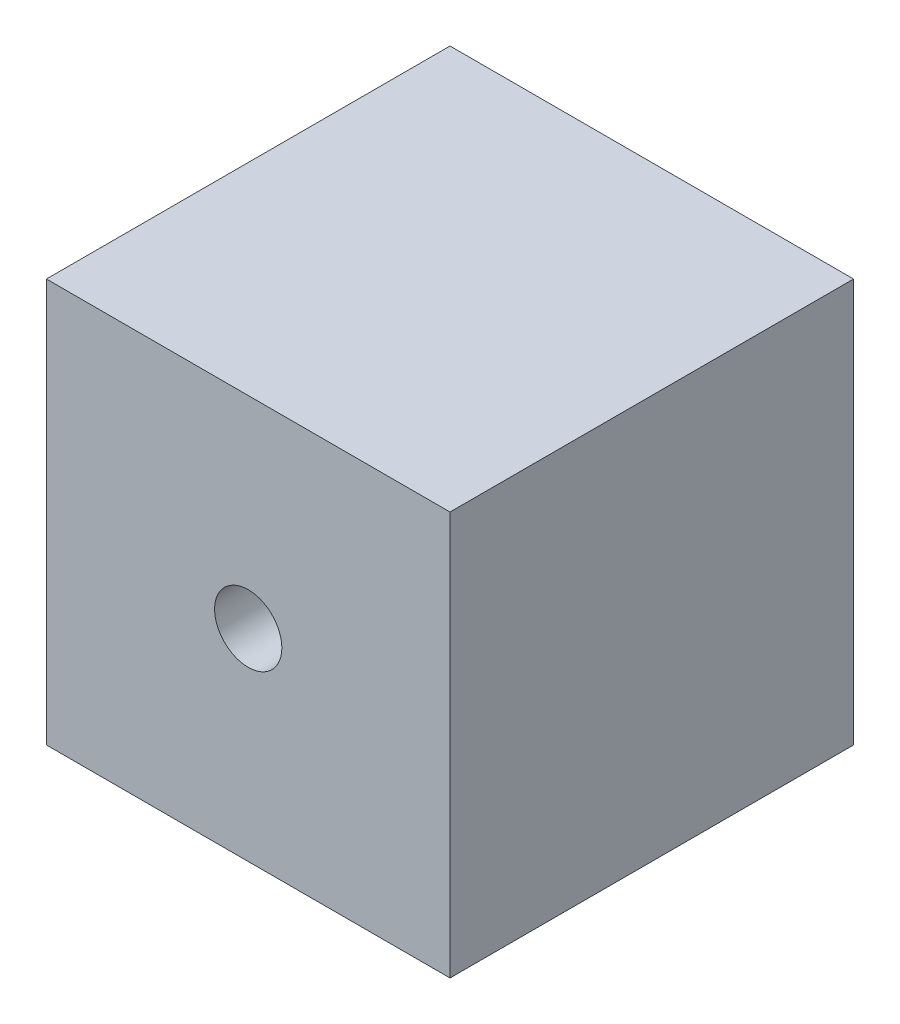
ISO-10303-21;
HEADER;
FILE_DESCRIPTION(('STEP AP214'),'2;1');
FILE_NAME('part.step','',(''),(''),'','','');
FILE_SCHEMA(('AUTOMOTIVE_DESIGN { 1 0 10303 214 1 1 1 1 }'));
ENDSEC;
DATA;
#1=APPLICATION_CONTEXT('core data for automotive mechanical design processes');
#2=APPLICATION_PROTOCOL_DEFINITION('international standard','automotive_design',2000,#1);
#3=PRODUCT_CONTEXT('',#1,'mechanical');
#4=PRODUCT('Part','Part','',(#3));
#5=PRODUCT_RELATED_PRODUCT_CATEGORY('part','',(#4));
#6=PRODUCT_DEFINITION_FORMATION('','',#4);
#7=PRODUCT_DEFINITION_CONTEXT('part definition',#1,'design');
#8=PRODUCT_DEFINITION('design','',#6,#7);
#9=PRODUCT_DEFINITION_SHAPE('','',#8);
#10=(LENGTH_UNIT() NAMED_UNIT(*) SI_UNIT(.MILLI.,.METRE.));
#11=(NAMED_UNIT(*) PLANE_ANGLE_UNIT() SI_UNIT($,.RADIAN.));
#12=(NAMED_UNIT(*) SI_UNIT($,.STERADIAN.) SOLID_ANGLE_UNIT());
#13=UNCERTAINTY_MEASURE_WITH_UNIT(LENGTH_MEASURE(1.E-05),#10,'distance_accuracy_value','');
#14=(GEOMETRIC_REPRESENTATION_CONTEXT(3) GLOBAL_UNCERTAINTY_ASSIGNED_CONTEXT((#13)) GLOBAL_UNIT_ASSIGNED_CONTEXT((#10,
#11,#12)) REPRESENTATION_CONTEXT('',''));
#15=CARTESIAN_POINT('',(0.,0.,0.));
#16=DIRECTION('',(0.,0.,1.));
#17=DIRECTION('',(1.,0.,0.));
#18=AXIS2_PLACEMENT_3D('',#15,#16,#17);
#19=CARTESIAN_POINT('',(15.,30.,0.));
#20=DIRECTION('',(0.,0.,-1.));
#21=DIRECTION('',(-1.,0.,0.));
#22=AXIS2_PLACEMENT_3D('',#19,#20,#21);
#23=PLANE('',#22);
#24=CARTESIAN_POINT('',(0.,15.,0.));
#25=DIRECTION('',(0.,0.,-1.));
#26=DIRECTION('',(-1.,0.,0.));
#27=AXIS2_PLACEMENT_3D('',#24,#25,#26);
#28=CIRCLE('',#27,2.5);
#29=CARTESIAN_POINT('',(-2.5,15.,0.));
#30=VERTEX_POINT('',#29);
#31=EDGE_CURVE('E36',#30,#30,#28,.T.);
#32=ORIENTED_EDGE('',*,*,#31,.T.);
#33=EDGE_LOOP('',(#32));
#34=FACE_BOUND('',#33,.T.);
#35=DIRECTION('',(0.,-1.,0.));
#36=VECTOR('',#35,1.);
#37=CARTESIAN_POINT('',(-15.,30.,0.));
#38=LINE('',#37,#36);
#39=CARTESIAN_POINT('',(-15.,30.,0.));
#40=VERTEX_POINT('',#39);
#41=CARTESIAN_POINT('',(-15.,0.,0.));
#42=VERTEX_POINT('',#41);
#43=EDGE_CURVE('E98',#40,#42,#38,.T.);
#44=ORIENTED_EDGE('',*,*,#43,.T.);
#45=DIRECTION('',(-1.,0.,0.));
#46=VECTOR('',#45,1.);
#47=CARTESIAN_POINT('',(15.,0.,0.));
#48=LINE('',#47,#46);
#49=CARTESIAN_POINT('',(15.,0.,0.));
#50=VERTEX_POINT('',#49);
#51=EDGE_CURVE('E11',#50,#42,#48,.T.);
#52=ORIENTED_EDGE('',*,*,#51,.F.);
#53=DIRECTION('',(0.,-1.,0.));
#54=VECTOR('',#53,1.);
#55=CARTESIAN_POINT('',(15.,30.,0.));
#56=LINE('',#55,#54);
#57=CARTESIAN_POINT('',(15.,30.,0.));
#58=VERTEX_POINT('',#57);
#59=EDGE_CURVE('E85',#58,#50,#56,.T.);
#60=ORIENTED_EDGE('',*,*,#59,.F.);
#61=DIRECTION('',(-1.,0.,0.));
#62=VECTOR('',#61,1.);
#63=CARTESIAN_POINT('',(15.,30.,0.));
#64=LINE('',#63,#62);
#65=EDGE_CURVE('E94',#58,#40,#64,.T.);
#66=ORIENTED_EDGE('',*,*,#65,.T.);
#67=EDGE_LOOP('',(#44,#52,#60,#66));
#68=FACE_BOUND('',#67,.T.);
#69=ADVANCED_FACE('F33',(#34,#68),#23,.F.);
#70=CARTESIAN_POINT('',(15.,0.,0.));
#71=DIRECTION('',(0.,1.,0.));
#72=DIRECTION('',(0.,0.,1.));
#73=AXIS2_PLACEMENT_3D('',#70,#71,#72);
#74=PLANE('',#73);
#75=DIRECTION('',(0.,0.,-1.));
#76=VECTOR('',#75,1.);
#77=CARTESIAN_POINT('',(-15.,0.,0.));
#78=LINE('',#77,#76);
#79=CARTESIAN_POINT('',(-15.,0.,-30.));
#80=VERTEX_POINT('',#79);
#81=EDGE_CURVE('E89',#42,#80,#78,.T.);
#82=ORIENTED_EDGE('',*,*,#81,.T.);
#83=DIRECTION('',(-1.,0.,0.));
#84=VECTOR('',#83,1.);
#85=CARTESIAN_POINT('',(15.,0.,-30.));
#86=LINE('',#85,#84);
#87=CARTESIAN_POINT('',(15.,0.,-30.));
#88=VERTEX_POINT('',#87);
#89=EDGE_CURVE('E42',#88,#80,#86,.T.);
#90=ORIENTED_EDGE('',*,*,#89,.F.);
#91=DIRECTION('',(0.,0.,-1.));
#92=VECTOR('',#91,1.);
#93=CARTESIAN_POINT('',(15.,0.,0.));
#94=LINE('',#93,#92);
#95=EDGE_CURVE('E80',#50,#88,#94,.T.);
#96=ORIENTED_EDGE('',*,*,#95,.F.);
#97=ORIENTED_EDGE('',*,*,#51,.T.);
#98=EDGE_LOOP('',(#82,#90,#96,#97));
#99=FACE_BOUND('',#98,.T.);
#100=ADVANCED_FACE('F88',(#99),#74,.F.);
#101=CARTESIAN_POINT('',(15.,0.,-30.));
#102=DIRECTION('',(0.,0.,1.));
#103=DIRECTION('',(1.,0.,0.));
#104=AXIS2_PLACEMENT_3D('',#101,#102,#103);
#105=PLANE('',#104);
#106=DIRECTION('',(0.,1.,0.));
#107=VECTOR('',#106,1.);
#108=CARTESIAN_POINT('',(-15.,0.,-30.));
#109=LINE('',#108,#107);
#110=CARTESIAN_POINT('',(-15.,30.,-30.));
#111=VERTEX_POINT('',#110);
#112=EDGE_CURVE('E67',#80,#111,#109,.T.);
#113=ORIENTED_EDGE('',*,*,#112,.T.);
#114=DIRECTION('',(-1.,0.,0.));
#115=VECTOR('',#114,1.);
#116=CARTESIAN_POINT('',(15.,30.,-30.));
#117=LINE('',#116,#115);
#118=CARTESIAN_POINT('',(15.,30.,-30.));
#119=VERTEX_POINT('',#118);
#120=EDGE_CURVE('E90',#119,#111,#117,.T.);
#121=ORIENTED_EDGE('',*,*,#120,.F.);
#122=DIRECTION('',(0.,1.,0.));
#123=VECTOR('',#122,1.);
#124=CARTESIAN_POINT('',(15.,0.,-30.));
#125=LINE('',#124,#123);
#126=EDGE_CURVE('E83',#88,#119,#125,.T.);
#127=ORIENTED_EDGE('',*,*,#126,.F.);
#128=ORIENTED_EDGE('',*,*,#89,.T.);
#129=EDGE_LOOP('',(#113,#121,#127,#128));
#130=FACE_BOUND('',#129,.T.);
#131=ADVANCED_FACE('F92',(#130),#105,.F.);
#132=CARTESIAN_POINT('',(15.,30.,-30.));
#133=DIRECTION('',(0.,-1.,0.));
#134=DIRECTION('',(0.,0.,-1.));
#135=AXIS2_PLACEMENT_3D('',#132,#133,#134);
#136=PLANE('',#135);
#137=DIRECTION('',(0.,0.,1.));
#138=VECTOR('',#137,1.);
#139=CARTESIAN_POINT('',(-15.,30.,-30.));
#140=LINE('',#139,#138);
#141=EDGE_CURVE('E73',#111,#40,#140,.T.);
#142=ORIENTED_EDGE('',*,*,#141,.T.);
#143=ORIENTED_EDGE('',*,*,#65,.F.);
#144=DIRECTION('',(0.,0.,1.));
#145=VECTOR('',#144,1.);
#146=CARTESIAN_POINT('',(15.,30.,-30.));
#147=LINE('',#146,#145);
#148=EDGE_CURVE('E50',#119,#58,#147,.T.);
#149=ORIENTED_EDGE('',*,*,#148,.F.);
#150=ORIENTED_EDGE('',*,*,#120,.T.);
#151=EDGE_LOOP('',(#142,#143,#149,#150));
#152=FACE_BOUND('',#151,.T.);
#153=ADVANCED_FACE('F105',(#152),#136,.F.);
#154=CARTESIAN_POINT('',(15.,0.,0.));
#155=DIRECTION('',(1.,0.,0.));
#156=DIRECTION('',(0.,0.,-1.));
#157=AXIS2_PLACEMENT_3D('',#154,#155,#156);
#158=PLANE('',#157);
#159=ORIENTED_EDGE('',*,*,#59,.T.);
#160=ORIENTED_EDGE('',*,*,#95,.T.);
#161=ORIENTED_EDGE('',*,*,#126,.T.);
#162=ORIENTED_EDGE('',*,*,#148,.T.);
#163=EDGE_LOOP('',(#159,#160,#161,#162));
#164=FACE_BOUND('',#163,.T.);
#165=ADVANCED_FACE('F81',(#164),#158,.T.);
#166=CARTESIAN_POINT('',(-15.,0.,0.));
#167=DIRECTION('',(1.,0.,0.));
#168=DIRECTION('',(0.,0.,-1.));
#169=AXIS2_PLACEMENT_3D('',#166,#167,#168);
#170=PLANE('',#169);
#171=ORIENTED_EDGE('',*,*,#43,.F.);
#172=ORIENTED_EDGE('',*,*,#141,.F.);
#173=ORIENTED_EDGE('',*,*,#112,.F.);
#174=ORIENTED_EDGE('',*,*,#81,.F.);
#175=EDGE_LOOP('',(#171,#172,#173,#174));
#176=FACE_BOUND('',#175,.T.);
#177=ADVANCED_FACE('F108',(#176),#170,.F.);
#178=CARTESIAN_POINT('',(0.,15.,-5.));
#179=DIRECTION('',(0.,0.,1.));
#180=DIRECTION('',(1.,0.,0.));
#181=AXIS2_PLACEMENT_3D('',#178,#179,#180);
#182=CYLINDRICAL_SURFACE('',#181,2.5);
#183=CARTESIAN_POINT('',(0.,15.,-5.));
#184=DIRECTION('',(0.,0.,1.));
#185=DIRECTION('',(1.,0.,0.));
#186=AXIS2_PLACEMENT_3D('',#183,#184,#185);
#187=CIRCLE('',#186,2.5);
#188=CARTESIAN_POINT('',(2.5,15.,-5.));
#189=VERTEX_POINT('',#188);
#190=EDGE_CURVE('E111',#189,#189,#187,.T.);
#191=ORIENTED_EDGE('',*,*,#190,.F.);
#192=EDGE_LOOP('',(#191));
#193=FACE_BOUND('',#192,.T.);
#194=ORIENTED_EDGE('',*,*,#31,.F.);
#195=EDGE_LOOP('',(#194));
#196=FACE_BOUND('',#195,.T.);
#197=ADVANCED_FACE('F119',(#193,#196),#182,.F.);
#198=CARTESIAN_POINT('',(0.,15.,-5.));
#199=DIRECTION('',(0.,0.,1.));
#200=DIRECTION('',(1.,0.,0.));
#201=AXIS2_PLACEMENT_3D('',#198,#199,#200);
#202=PLANE('',#201);
#203=ORIENTED_EDGE('',*,*,#190,.T.);
#204=EDGE_LOOP('',(#203));
#205=FACE_BOUND('',#204,.T.);
#206=ADVANCED_FACE('F121',(#205),#202,.T.);
#207=CLOSED_SHELL('',(#69,#100,#131,#153,#165,#177,#197,#206));
#208=MANIFOLD_SOLID_BREP('B2',#207);
#209=ADVANCED_BREP_SHAPE_REPRESENTATION('',(#18,#208),#14);
#210=SHAPE_DEFINITION_REPRESENTATION(#9,#209);
ENDSEC;
END-ISO-10303-21;
